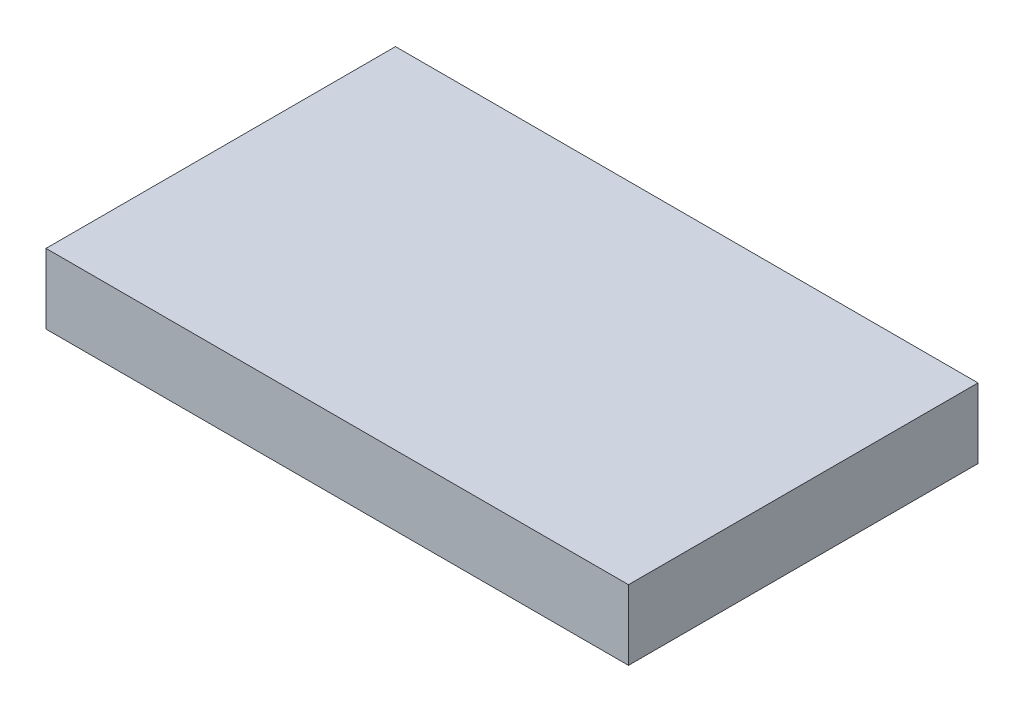
ISO-10303-21;
HEADER;
FILE_DESCRIPTION(('STEP AP214'),'2;1');
FILE_NAME('part.step','',(''),(''),'','','');
FILE_SCHEMA(('AUTOMOTIVE_DESIGN { 1 0 10303 214 1 1 1 1 }'));
ENDSEC;
DATA;
#1=APPLICATION_CONTEXT('core data for automotive mechanical design processes');
#2=APPLICATION_PROTOCOL_DEFINITION('international standard','automotive_design',2000,#1);
#3=PRODUCT_CONTEXT('',#1,'mechanical');
#4=PRODUCT('Part','Part','',(#3));
#5=PRODUCT_RELATED_PRODUCT_CATEGORY('part','',(#4));
#6=PRODUCT_DEFINITION_FORMATION('','',#4);
#7=PRODUCT_DEFINITION_CONTEXT('part definition',#1,'design');
#8=PRODUCT_DEFINITION('design','',#6,#7);
#9=PRODUCT_DEFINITION_SHAPE('','',#8);
#10=(LENGTH_UNIT() NAMED_UNIT(*) SI_UNIT(.MILLI.,.METRE.));
#11=(NAMED_UNIT(*) PLANE_ANGLE_UNIT() SI_UNIT($,.RADIAN.));
#12=(NAMED_UNIT(*) SI_UNIT($,.STERADIAN.) SOLID_ANGLE_UNIT());
#13=UNCERTAINTY_MEASURE_WITH_UNIT(LENGTH_MEASURE(1.E-05),#10,'distance_accuracy_value','');
#14=(GEOMETRIC_REPRESENTATION_CONTEXT(3) GLOBAL_UNCERTAINTY_ASSIGNED_CONTEXT((#13)) GLOBAL_UNIT_ASSIGNED_CONTEXT((#10,
#11,#12)) REPRESENTATION_CONTEXT('',''));
#15=CARTESIAN_POINT('',(0.,0.,0.));
#16=DIRECTION('',(0.,0.,1.));
#17=DIRECTION('',(1.,0.,0.));
#18=AXIS2_PLACEMENT_3D('',#15,#16,#17);
#19=CARTESIAN_POINT('',(25.,6.,-15.));
#20=DIRECTION('',(-1.,0.,0.));
#21=DIRECTION('',(0.,0.,1.));
#22=AXIS2_PLACEMENT_3D('',#19,#20,#21);
#23=PLANE('',#22);
#24=DIRECTION('',(0.,0.,-1.));
#25=VECTOR('',#24,1.);
#26=CARTESIAN_POINT('',(25.,0.,-15.));
#27=LINE('',#26,#25);
#28=CARTESIAN_POINT('',(25.,0.,15.));
#29=VERTEX_POINT('',#28);
#30=CARTESIAN_POINT('',(25.,0.,-15.));
#31=VERTEX_POINT('',#30);
#32=EDGE_CURVE('E96',#29,#31,#27,.T.);
#33=ORIENTED_EDGE('',*,*,#32,.T.);
#34=DIRECTION('',(0.,-1.,0.));
#35=VECTOR('',#34,1.);
#36=CARTESIAN_POINT('',(25.,6.,-15.));
#37=LINE('',#36,#35);
#38=CARTESIAN_POINT('',(25.,6.,-15.));
#39=VERTEX_POINT('',#38);
#40=EDGE_CURVE('E11',#39,#31,#37,.T.);
#41=ORIENTED_EDGE('',*,*,#40,.F.);
#42=DIRECTION('',(0.,0.,-1.));
#43=VECTOR('',#42,1.);
#44=CARTESIAN_POINT('',(25.,6.,-15.));
#45=LINE('',#44,#43);
#46=CARTESIAN_POINT('',(25.,6.,15.));
#47=VERTEX_POINT('',#46);
#48=EDGE_CURVE('E84',#47,#39,#45,.T.);
#49=ORIENTED_EDGE('',*,*,#48,.F.);
#50=DIRECTION('',(0.,-1.,0.));
#51=VECTOR('',#50,1.);
#52=CARTESIAN_POINT('',(25.,6.,15.));
#53=LINE('',#52,#51);
#54=EDGE_CURVE('E92',#47,#29,#53,.T.);
#55=ORIENTED_EDGE('',*,*,#54,.T.);
#56=EDGE_LOOP('',(#33,#41,#49,#55));
#57=FACE_BOUND('',#56,.T.);
#58=ADVANCED_FACE('F33',(#57),#23,.F.);
#59=CARTESIAN_POINT('',(-25.,6.,-15.));
#60=DIRECTION('',(0.,0.,1.));
#61=DIRECTION('',(1.,0.,0.));
#62=AXIS2_PLACEMENT_3D('',#59,#60,#61);
#63=PLANE('',#62);
#64=DIRECTION('',(-1.,0.,0.));
#65=VECTOR('',#64,1.);
#66=CARTESIAN_POINT('',(-25.,0.,-15.));
#67=LINE('',#66,#65);
#68=CARTESIAN_POINT('',(-25.,0.,-15.));
#69=VERTEX_POINT('',#68);
#70=EDGE_CURVE('E88',#31,#69,#67,.T.);
#71=ORIENTED_EDGE('',*,*,#70,.T.);
#72=DIRECTION('',(0.,-1.,0.));
#73=VECTOR('',#72,1.);
#74=CARTESIAN_POINT('',(-25.,6.,-15.));
#75=LINE('',#74,#73);
#76=CARTESIAN_POINT('',(-25.,6.,-15.));
#77=VERTEX_POINT('',#76);
#78=EDGE_CURVE('E41',#77,#69,#75,.T.);
#79=ORIENTED_EDGE('',*,*,#78,.F.);
#80=DIRECTION('',(-1.,0.,0.));
#81=VECTOR('',#80,1.);
#82=CARTESIAN_POINT('',(-25.,6.,-15.));
#83=LINE('',#82,#81);
#84=EDGE_CURVE('E79',#39,#77,#83,.T.);
#85=ORIENTED_EDGE('',*,*,#84,.F.);
#86=ORIENTED_EDGE('',*,*,#40,.T.);
#87=EDGE_LOOP('',(#71,#79,#85,#86));
#88=FACE_BOUND('',#87,.T.);
#89=ADVANCED_FACE('F87',(#88),#63,.F.);
#90=CARTESIAN_POINT('',(-25.,6.,-15.));
#91=DIRECTION('',(1.,0.,0.));
#92=DIRECTION('',(0.,0.,-1.));
#93=AXIS2_PLACEMENT_3D('',#90,#91,#92);
#94=PLANE('',#93);
#95=DIRECTION('',(0.,0.,1.));
#96=VECTOR('',#95,1.);
#97=CARTESIAN_POINT('',(-25.,0.,-15.));
#98=LINE('',#97,#96);
#99=CARTESIAN_POINT('',(-25.,0.,15.));
#100=VERTEX_POINT('',#99);
#101=EDGE_CURVE('E66',#69,#100,#98,.T.);
#102=ORIENTED_EDGE('',*,*,#101,.T.);
#103=DIRECTION('',(0.,-1.,0.));
#104=VECTOR('',#103,1.);
#105=CARTESIAN_POINT('',(-25.,6.,15.));
#106=LINE('',#105,#104);
#107=CARTESIAN_POINT('',(-25.,6.,15.));
#108=VERTEX_POINT('',#107);
#109=EDGE_CURVE('E89',#108,#100,#106,.T.);
#110=ORIENTED_EDGE('',*,*,#109,.F.);
#111=DIRECTION('',(0.,0.,1.));
#112=VECTOR('',#111,1.);
#113=CARTESIAN_POINT('',(-25.,6.,-15.));
#114=LINE('',#113,#112);
#115=EDGE_CURVE('E82',#77,#108,#114,.T.);
#116=ORIENTED_EDGE('',*,*,#115,.F.);
#117=ORIENTED_EDGE('',*,*,#78,.T.);
#118=EDGE_LOOP('',(#102,#110,#116,#117));
#119=FACE_BOUND('',#118,.T.);
#120=ADVANCED_FACE('F90',(#119),#94,.F.);
#121=CARTESIAN_POINT('',(-25.,6.,15.));
#122=DIRECTION('',(0.,0.,-1.));
#123=DIRECTION('',(-1.,0.,0.));
#124=AXIS2_PLACEMENT_3D('',#121,#122,#123);
#125=PLANE('',#124);
#126=DIRECTION('',(1.,0.,0.));
#127=VECTOR('',#126,1.);
#128=CARTESIAN_POINT('',(-25.,0.,15.));
#129=LINE('',#128,#127);
#130=EDGE_CURVE('E72',#100,#29,#129,.T.);
#131=ORIENTED_EDGE('',*,*,#130,.T.);
#132=ORIENTED_EDGE('',*,*,#54,.F.);
#133=DIRECTION('',(1.,0.,0.));
#134=VECTOR('',#133,1.);
#135=CARTESIAN_POINT('',(-25.,6.,15.));
#136=LINE('',#135,#134);
#137=EDGE_CURVE('E49',#108,#47,#136,.T.);
#138=ORIENTED_EDGE('',*,*,#137,.F.);
#139=ORIENTED_EDGE('',*,*,#109,.T.);
#140=EDGE_LOOP('',(#131,#132,#138,#139));
#141=FACE_BOUND('',#140,.T.);
#142=ADVANCED_FACE('F103',(#141),#125,.F.);
#143=CARTESIAN_POINT('',(0.,6.,0.));
#144=DIRECTION('',(0.,1.,0.));
#145=DIRECTION('',(0.,0.,1.));
#146=AXIS2_PLACEMENT_3D('',#143,#144,#145);
#147=PLANE('',#146);
#148=ORIENTED_EDGE('',*,*,#48,.T.);
#149=ORIENTED_EDGE('',*,*,#84,.T.);
#150=ORIENTED_EDGE('',*,*,#115,.T.);
#151=ORIENTED_EDGE('',*,*,#137,.T.);
#152=EDGE_LOOP('',(#148,#149,#150,#151));
#153=FACE_BOUND('',#152,.T.);
#154=ADVANCED_FACE('F80',(#153),#147,.T.);
#155=CARTESIAN_POINT('',(0.,0.,0.));
#156=DIRECTION('',(0.,1.,0.));
#157=DIRECTION('',(0.,0.,1.));
#158=AXIS2_PLACEMENT_3D('',#155,#156,#157);
#159=PLANE('',#158);
#160=ORIENTED_EDGE('',*,*,#32,.F.);
#161=ORIENTED_EDGE('',*,*,#130,.F.);
#162=ORIENTED_EDGE('',*,*,#101,.F.);
#163=ORIENTED_EDGE('',*,*,#70,.F.);
#164=EDGE_LOOP('',(#160,#161,#162,#163));
#165=FACE_BOUND('',#164,.T.);
#166=ADVANCED_FACE('F106',(#165),#159,.F.);
#167=CLOSED_SHELL('',(#58,#89,#120,#142,#154,#166));
#168=MANIFOLD_SOLID_BREP('B2',#167);
#169=ADVANCED_BREP_SHAPE_REPRESENTATION('',(#18,#168),#14);
#170=SHAPE_DEFINITION_REPRESENTATION(#9,#169);
ENDSEC;
END-ISO-10303-21;
